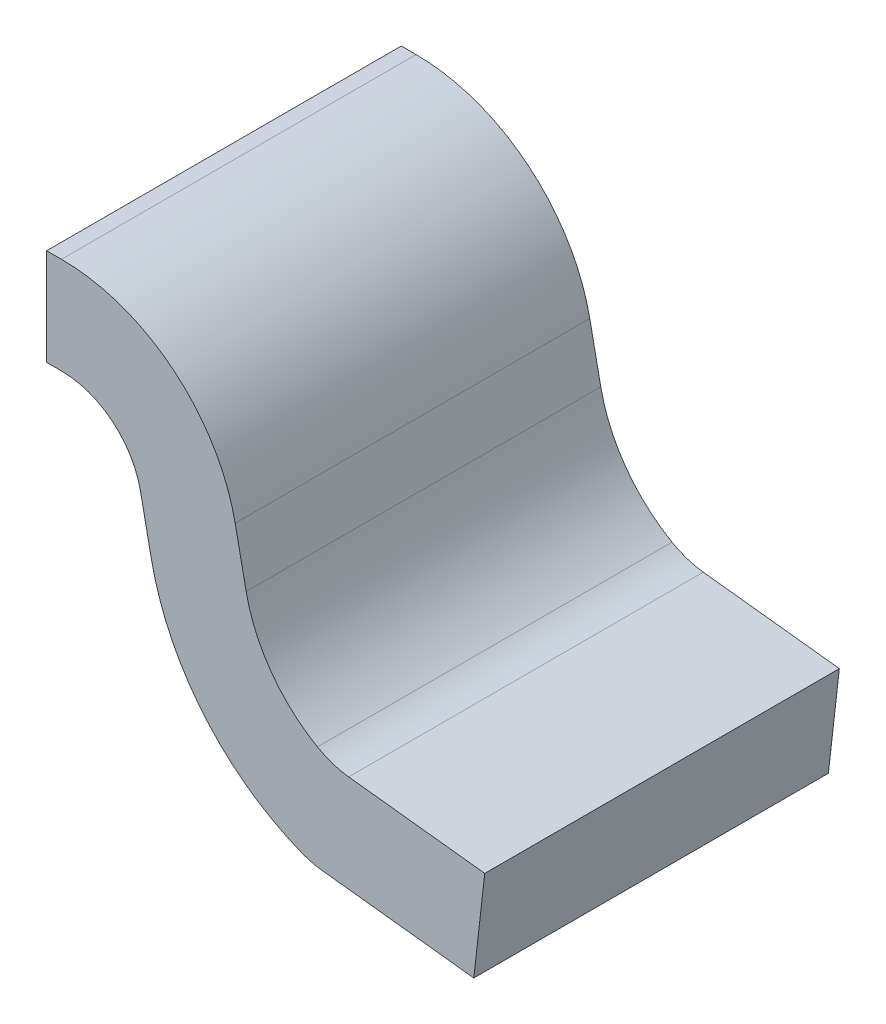
ISO-10303-21;
HEADER;
FILE_DESCRIPTION(('STEP AP214'),'2;1');
FILE_NAME('part.step','',(''),(''),'','','');
FILE_SCHEMA(('AUTOMOTIVE_DESIGN { 1 0 10303 214 1 1 1 1 }'));
ENDSEC;
DATA;
#1=APPLICATION_CONTEXT('core data for automotive mechanical design processes');
#2=APPLICATION_PROTOCOL_DEFINITION('international standard','automotive_design',2000,#1);
#3=PRODUCT_CONTEXT('',#1,'mechanical');
#4=PRODUCT('Part','Part','',(#3));
#5=PRODUCT_RELATED_PRODUCT_CATEGORY('part','',(#4));
#6=PRODUCT_DEFINITION_FORMATION('','',#4);
#7=PRODUCT_DEFINITION_CONTEXT('part definition',#1,'design');
#8=PRODUCT_DEFINITION('design','',#6,#7);
#9=PRODUCT_DEFINITION_SHAPE('','',#8);
#10=(LENGTH_UNIT() NAMED_UNIT(*) SI_UNIT(.MILLI.,.METRE.));
#11=(NAMED_UNIT(*) PLANE_ANGLE_UNIT() SI_UNIT($,.RADIAN.));
#12=(NAMED_UNIT(*) SI_UNIT($,.STERADIAN.) SOLID_ANGLE_UNIT());
#13=UNCERTAINTY_MEASURE_WITH_UNIT(LENGTH_MEASURE(1.E-05),#10,'distance_accuracy_value','');
#14=(GEOMETRIC_REPRESENTATION_CONTEXT(3) GLOBAL_UNCERTAINTY_ASSIGNED_CONTEXT((#13)) GLOBAL_UNIT_ASSIGNED_CONTEXT((#10,
#11,#12)) REPRESENTATION_CONTEXT('',''));
#15=CARTESIAN_POINT('',(0.,0.,0.));
#16=DIRECTION('',(0.,0.,1.));
#17=DIRECTION('',(1.,0.,0.));
#18=AXIS2_PLACEMENT_3D('',#15,#16,#17);
#19=CARTESIAN_POINT('',(1.0784798395513,0.311122151443952,3.64984430510635));
#20=DIRECTION('',(0.,0.,-1.));
#21=DIRECTION('',(-1.,0.,0.));
#22=AXIS2_PLACEMENT_3D('',#19,#20,#21);
#23=CYLINDRICAL_SURFACE('',#22,0.304673812487565);
#24=DIRECTION('',(0.,0.,1.));
#25=VECTOR('',#24,1.);
#26=CARTESIAN_POINT('',(0.966363747755728,0.0278270509282633,3.64984430510635));
#27=LINE('',#26,#25);
#28=CARTESIAN_POINT('',(0.966363747755728,0.0278270509282633,2.18));
#29=VERTEX_POINT('',#28);
#30=CARTESIAN_POINT('',(0.966363747755728,0.0278270509282633,2.62));
#31=VERTEX_POINT('',#30);
#32=EDGE_CURVE('E11',#29,#31,#27,.T.);
#33=ORIENTED_EDGE('',*,*,#32,.T.);
#34=CARTESIAN_POINT('',(1.0784798395513,0.311122151443952,2.62));
#35=DIRECTION('',(0.,0.,-1.));
#36=DIRECTION('',(-1.,0.,0.));
#37=AXIS2_PLACEMENT_3D('',#34,#35,#36);
#38=CIRCLE('',#37,0.304673812487565);
#39=CARTESIAN_POINT('',(0.78,0.25,2.62));
#40=VERTEX_POINT('',#39);
#41=EDGE_CURVE('E26',#31,#40,#38,.T.);
#42=ORIENTED_EDGE('',*,*,#41,.T.);
#43=DIRECTION('',(0.,0.,-1.));
#44=VECTOR('',#43,1.);
#45=CARTESIAN_POINT('',(0.78,0.25,3.64984430510635));
#46=LINE('',#45,#44);
#47=CARTESIAN_POINT('',(0.78,0.25,2.18));
#48=VERTEX_POINT('',#47);
#49=EDGE_CURVE('E252',#40,#48,#46,.T.);
#50=ORIENTED_EDGE('',*,*,#49,.T.);
#51=CARTESIAN_POINT('',(1.0784798395513,0.311122151443952,2.18));
#52=DIRECTION('',(0.,0.,1.));
#53=DIRECTION('',(-1.,0.,0.));
#54=AXIS2_PLACEMENT_3D('',#51,#52,#53);
#55=CIRCLE('',#54,0.304673812487565);
#56=EDGE_CURVE('E150',#48,#29,#55,.T.);
#57=ORIENTED_EDGE('',*,*,#56,.T.);
#58=EDGE_LOOP('',(#33,#42,#50,#57));
#59=FACE_BOUND('',#58,.T.);
#60=ADVANCED_FACE('F16',(#59),#23,.T.);
#61=CARTESIAN_POINT('',(-2.74150408033977,0.,2.62));
#62=DIRECTION('',(0.,0.,-1.));
#63=DIRECTION('',(0.707106781186548,0.707106781186548,0.));
#64=AXIS2_PLACEMENT_3D('',#61,#62,#63);
#65=PLANE('',#64);
#66=DIRECTION('',(-0.200615047761769,0.979670149903294,0.));
#67=VECTOR('',#66,1.);
#68=CARTESIAN_POINT('',(0.78,0.25,2.62));
#69=LINE('',#68,#67);
#70=CARTESIAN_POINT('',(0.766369657725015,0.316561504776177,2.62));
#71=VERTEX_POINT('',#70);
#72=EDGE_CURVE('E190',#40,#71,#69,.T.);
#73=ORIENTED_EDGE('',*,*,#72,.F.);
#74=ORIENTED_EDGE('',*,*,#41,.F.);
#75=CARTESIAN_POINT('',(1.003162477151,0.120810132802834,2.62));
#76=DIRECTION('',(0.,0.,-1.));
#77=DIRECTION('',(-1.,0.,0.));
#78=AXIS2_PLACEMENT_3D('',#75,#76,#77);
#79=CIRCLE('',#78,0.1);
#80=CARTESIAN_POINT('',(0.991834300901522,0.0214538424993983,2.62));
#81=VERTEX_POINT('',#80);
#82=EDGE_CURVE('E151',#81,#31,#79,.T.);
#83=ORIENTED_EDGE('',*,*,#82,.F.);
#84=DIRECTION('',(-0.993562903034357,0.113281762494854,0.));
#85=VECTOR('',#84,1.);
#86=CARTESIAN_POINT('',(1.17999999999987,0.,2.62));
#87=LINE('',#86,#85);
#88=CARTESIAN_POINT('',(1.17999999999987,0.,2.62));
#89=VERTEX_POINT('',#88);
#90=EDGE_CURVE('E184',#89,#81,#87,.T.);
#91=ORIENTED_EDGE('',*,*,#90,.F.);
#92=DIRECTION('',(-0.113281762495859,-0.993562903034243,0.));
#93=VECTOR('',#92,1.);
#94=CARTESIAN_POINT('',(1.19359381149938,0.119227548364123,2.62));
#95=LINE('',#94,#93);
#96=CARTESIAN_POINT('',(1.19359381149938,0.119227548364123,2.62));
#97=VERTEX_POINT('',#96);
#98=EDGE_CURVE('E185',#97,#89,#95,.T.);
#99=ORIENTED_EDGE('',*,*,#98,.F.);
#100=DIRECTION('',(0.993562903034362,-0.113281762494814,0.));
#101=VECTOR('',#100,1.);
#102=CARTESIAN_POINT('',(1.02473971532561,0.138479565081551,2.62));
#103=LINE('',#102,#101);
#104=CARTESIAN_POINT('',(1.02473971532561,0.138479565081551,2.62));
#105=VERTEX_POINT('',#104);
#106=EDGE_CURVE('E180',#105,#97,#103,.T.);
#107=ORIENTED_EDGE('',*,*,#106,.F.);
#108=CARTESIAN_POINT('',(1.03606789157509,0.237835855384987,2.62));
#109=DIRECTION('',(0.,0.,1.));
#110=DIRECTION('',(-1.,0.,0.));
#111=AXIS2_PLACEMENT_3D('',#108,#109,#110);
#112=CIRCLE('',#111,0.1);
#113=CARTESIAN_POINT('',(0.985979267087511,0.151284542876497,2.62));
#114=VERTEX_POINT('',#113);
#115=EDGE_CURVE('E175',#114,#105,#112,.T.);
#116=ORIENTED_EDGE('',*,*,#115,.F.);
#117=CARTESIAN_POINT('',(1.0784798395513,0.311122151443952,2.62));
#118=DIRECTION('',(0.,0.,1.));
#119=DIRECTION('',(-1.,0.,0.));
#120=AXIS2_PLACEMENT_3D('',#117,#118,#119);
#121=CIRCLE('',#120,0.184673812487565);
#122=CARTESIAN_POINT('',(0.897560417988396,0.274073805731411,2.62));
#123=VERTEX_POINT('',#122);
#124=EDGE_CURVE('E170',#123,#114,#121,.T.);
#125=ORIENTED_EDGE('',*,*,#124,.F.);
#126=DIRECTION('',(0.20061504776177,-0.979670149903294,0.));
#127=VECTOR('',#126,1.);
#128=CARTESIAN_POINT('',(0.883930075713411,0.340635310507587,2.62));
#129=LINE('',#128,#127);
#130=CARTESIAN_POINT('',(0.883930075713411,0.340635310507588,2.62));
#131=VERTEX_POINT('',#130);
#132=EDGE_CURVE('E165',#131,#123,#129,.T.);
#133=ORIENTED_EDGE('',*,*,#132,.F.);
#134=CARTESIAN_POINT('',(0.668402642734686,0.2965,2.62));
#135=DIRECTION('',(0.,0.,-1.));
#136=DIRECTION('',(-1.,0.,0.));
#137=AXIS2_PLACEMENT_3D('',#134,#135,#136);
#138=CIRCLE('',#137,0.22);
#139=CARTESIAN_POINT('',(0.668402642734686,0.5165,2.62));
#140=VERTEX_POINT('',#139);
#141=EDGE_CURVE('E208',#140,#131,#138,.T.);
#142=ORIENTED_EDGE('',*,*,#141,.F.);
#143=DIRECTION('',(1.,0.,0.));
#144=VECTOR('',#143,1.);
#145=CARTESIAN_POINT('',(-2.74150408033977,0.5165,2.62));
#146=LINE('',#145,#144);
#147=CARTESIAN_POINT('',(0.65,0.5165,2.62));
#148=VERTEX_POINT('',#147);
#149=EDGE_CURVE('E132',#148,#140,#146,.T.);
#150=ORIENTED_EDGE('',*,*,#149,.F.);
#151=DIRECTION('',(0.,1.,0.));
#152=VECTOR('',#151,1.);
#153=CARTESIAN_POINT('',(0.65,0.,2.62));
#154=LINE('',#153,#152);
#155=CARTESIAN_POINT('',(0.65,0.3965,2.62));
#156=VERTEX_POINT('',#155);
#157=EDGE_CURVE('E133',#156,#148,#154,.T.);
#158=ORIENTED_EDGE('',*,*,#157,.F.);
#159=DIRECTION('',(-1.,0.,0.));
#160=VECTOR('',#159,1.);
#161=CARTESIAN_POINT('',(-2.74150408033977,0.3965,2.62));
#162=LINE('',#161,#160);
#163=CARTESIAN_POINT('',(0.668402642734686,0.3965,2.62));
#164=VERTEX_POINT('',#163);
#165=EDGE_CURVE('E135',#164,#156,#162,.T.);
#166=ORIENTED_EDGE('',*,*,#165,.F.);
#167=CARTESIAN_POINT('',(0.668402642734686,0.2965,2.62));
#168=DIRECTION('',(0.,0.,1.));
#169=DIRECTION('',(-1.,0.,0.));
#170=AXIS2_PLACEMENT_3D('',#167,#168,#169);
#171=CIRCLE('',#170,0.1);
#172=EDGE_CURVE('E142',#71,#164,#171,.T.);
#173=ORIENTED_EDGE('',*,*,#172,.F.);
#174=EDGE_LOOP('',(#73,#74,#83,#91,#99,#107,#116,#125,#133,#142,#150,#158,#166,#173));
#175=FACE_BOUND('',#174,.T.);
#176=ADVANCED_FACE('F212',(#175),#65,.F.);
#177=CARTESIAN_POINT('',(1.003162477151,0.120810132802834,3.64984430510635));
#178=DIRECTION('',(0.,0.,-1.));
#179=DIRECTION('',(-1.,0.,0.));
#180=AXIS2_PLACEMENT_3D('',#177,#178,#179);
#181=CYLINDRICAL_SURFACE('',#180,0.1);
#182=DIRECTION('',(0.,0.,1.));
#183=VECTOR('',#182,1.);
#184=CARTESIAN_POINT('',(0.991834300901524,0.0214538424993981,3.64984430510635));
#185=LINE('',#184,#183);
#186=CARTESIAN_POINT('',(0.991834300901522,0.0214538424993983,2.18));
#187=VERTEX_POINT('',#186);
#188=EDGE_CURVE('E147',#187,#81,#185,.T.);
#189=ORIENTED_EDGE('',*,*,#188,.T.);
#190=ORIENTED_EDGE('',*,*,#82,.T.);
#191=ORIENTED_EDGE('',*,*,#32,.F.);
#192=CARTESIAN_POINT('',(1.003162477151,0.120810132802834,2.18));
#193=DIRECTION('',(0.,0.,1.));
#194=DIRECTION('',(-1.,0.,0.));
#195=AXIS2_PLACEMENT_3D('',#192,#193,#194);
#196=CIRCLE('',#195,0.1);
#197=EDGE_CURVE('E152',#29,#187,#196,.T.);
#198=ORIENTED_EDGE('',*,*,#197,.T.);
#199=EDGE_LOOP('',(#189,#190,#191,#198));
#200=FACE_BOUND('',#199,.T.);
#201=ADVANCED_FACE('F247',(#200),#181,.T.);
#202=CARTESIAN_POINT('',(-2.74150408033977,0.,2.18));
#203=DIRECTION('',(0.,0.,1.));
#204=DIRECTION('',(0.707106781186548,0.707106781186548,0.));
#205=AXIS2_PLACEMENT_3D('',#202,#203,#204);
#206=PLANE('',#205);
#207=DIRECTION('',(-1.,0.,0.));
#208=VECTOR('',#207,1.);
#209=CARTESIAN_POINT('',(-2.74150408033977,0.5165,2.18));
#210=LINE('',#209,#208);
#211=CARTESIAN_POINT('',(0.668402642734686,0.5165,2.18));
#212=VERTEX_POINT('',#211);
#213=CARTESIAN_POINT('',(0.65,0.5165,2.18));
#214=VERTEX_POINT('',#213);
#215=EDGE_CURVE('E155',#212,#214,#210,.T.);
#216=ORIENTED_EDGE('',*,*,#215,.F.);
#217=CARTESIAN_POINT('',(0.668402642734686,0.2965,2.18));
#218=DIRECTION('',(0.,0.,1.));
#219=DIRECTION('',(-1.,0.,0.));
#220=AXIS2_PLACEMENT_3D('',#217,#218,#219);
#221=CIRCLE('',#220,0.22);
#222=CARTESIAN_POINT('',(0.883930075713411,0.340635310507588,2.18));
#223=VERTEX_POINT('',#222);
#224=EDGE_CURVE('E157',#223,#212,#221,.T.);
#225=ORIENTED_EDGE('',*,*,#224,.F.);
#226=DIRECTION('',(-0.20061504776177,0.979670149903294,0.));
#227=VECTOR('',#226,1.);
#228=CARTESIAN_POINT('',(0.897560417988396,0.274073805731412,2.18));
#229=LINE('',#228,#227);
#230=CARTESIAN_POINT('',(0.897560417988396,0.274073805731411,2.18));
#231=VERTEX_POINT('',#230);
#232=EDGE_CURVE('E161',#231,#223,#229,.T.);
#233=ORIENTED_EDGE('',*,*,#232,.F.);
#234=CARTESIAN_POINT('',(1.0784798395513,0.311122151443952,2.18));
#235=DIRECTION('',(0.,0.,-1.));
#236=DIRECTION('',(-1.,0.,0.));
#237=AXIS2_PLACEMENT_3D('',#234,#235,#236);
#238=CIRCLE('',#237,0.184673812487565);
#239=CARTESIAN_POINT('',(0.985979267087511,0.151284542876497,2.18));
#240=VERTEX_POINT('',#239);
#241=EDGE_CURVE('E166',#240,#231,#238,.T.);
#242=ORIENTED_EDGE('',*,*,#241,.F.);
#243=CARTESIAN_POINT('',(1.03606789157509,0.237835855384987,2.18));
#244=DIRECTION('',(0.,0.,-1.));
#245=DIRECTION('',(-1.,0.,0.));
#246=AXIS2_PLACEMENT_3D('',#243,#244,#245);
#247=CIRCLE('',#246,0.1);
#248=CARTESIAN_POINT('',(1.02473971532561,0.138479565081551,2.18));
#249=VERTEX_POINT('',#248);
#250=EDGE_CURVE('E171',#249,#240,#247,.T.);
#251=ORIENTED_EDGE('',*,*,#250,.F.);
#252=DIRECTION('',(-0.993562903034363,0.113281762494801,0.));
#253=VECTOR('',#252,1.);
#254=CARTESIAN_POINT('',(1.19359381149938,0.119227548364125,2.18));
#255=LINE('',#254,#253);
#256=CARTESIAN_POINT('',(1.19359381149938,0.119227548364124,2.18));
#257=VERTEX_POINT('',#256);
#258=EDGE_CURVE('E176',#257,#249,#255,.T.);
#259=ORIENTED_EDGE('',*,*,#258,.F.);
#260=DIRECTION('',(0.113281762495857,0.993562903034243,0.));
#261=VECTOR('',#260,1.);
#262=CARTESIAN_POINT('',(1.17999999999987,0.,2.18));
#263=LINE('',#262,#261);
#264=CARTESIAN_POINT('',(1.17999999999987,0.,2.18));
#265=VERTEX_POINT('',#264);
#266=EDGE_CURVE('E181',#265,#257,#263,.T.);
#267=ORIENTED_EDGE('',*,*,#266,.F.);
#268=DIRECTION('',(0.993562903034357,-0.113281762494854,0.));
#269=VECTOR('',#268,1.);
#270=CARTESIAN_POINT('',(0.991834300901524,0.0214538424993981,2.18));
#271=LINE('',#270,#269);
#272=EDGE_CURVE('E146',#187,#265,#271,.T.);
#273=ORIENTED_EDGE('',*,*,#272,.F.);
#274=ORIENTED_EDGE('',*,*,#197,.F.);
#275=ORIENTED_EDGE('',*,*,#56,.F.);
#276=DIRECTION('',(0.200615047761769,-0.979670149903294,0.));
#277=VECTOR('',#276,1.);
#278=CARTESIAN_POINT('',(0.766369657725015,0.316561504776176,2.18));
#279=LINE('',#278,#277);
#280=CARTESIAN_POINT('',(0.766369657725015,0.316561504776177,2.18));
#281=VERTEX_POINT('',#280);
#282=EDGE_CURVE('E154',#281,#48,#279,.T.);
#283=ORIENTED_EDGE('',*,*,#282,.F.);
#284=CARTESIAN_POINT('',(0.668402642734686,0.2965,2.18));
#285=DIRECTION('',(0.,0.,-1.));
#286=DIRECTION('',(-1.,0.,0.));
#287=AXIS2_PLACEMENT_3D('',#284,#285,#286);
#288=CIRCLE('',#287,0.1);
#289=CARTESIAN_POINT('',(0.668402642734686,0.3965,2.18));
#290=VERTEX_POINT('',#289);
#291=EDGE_CURVE('E122',#290,#281,#288,.T.);
#292=ORIENTED_EDGE('',*,*,#291,.F.);
#293=DIRECTION('',(1.,0.,0.));
#294=VECTOR('',#293,1.);
#295=CARTESIAN_POINT('',(-2.74150408033977,0.3965,2.18));
#296=LINE('',#295,#294);
#297=CARTESIAN_POINT('',(0.65,0.3965,2.18));
#298=VERTEX_POINT('',#297);
#299=EDGE_CURVE('E114',#298,#290,#296,.T.);
#300=ORIENTED_EDGE('',*,*,#299,.F.);
#301=DIRECTION('',(0.,-1.,0.));
#302=VECTOR('',#301,1.);
#303=CARTESIAN_POINT('',(0.65,0.,2.18));
#304=LINE('',#303,#302);
#305=EDGE_CURVE('E119',#214,#298,#304,.T.);
#306=ORIENTED_EDGE('',*,*,#305,.F.);
#307=EDGE_LOOP('',(#216,#225,#233,#242,#251,#259,#267,#273,#274,#275,#283,#292,#300,#306));
#308=FACE_BOUND('',#307,.T.);
#309=ADVANCED_FACE('F118',(#308),#206,.F.);
#310=CARTESIAN_POINT('',(0.766369657725015,0.316561504776176,3.64984430510635));
#311=DIRECTION('',(0.979670149903295,0.200615047761767,0.));
#312=DIRECTION('',(-0.143305470647058,0.699808381659803,0.699808381659803));
#313=AXIS2_PLACEMENT_3D('',#310,#311,#312);
#314=PLANE('',#313);
#315=ORIENTED_EDGE('',*,*,#282,.T.);
#316=ORIENTED_EDGE('',*,*,#49,.F.);
#317=ORIENTED_EDGE('',*,*,#72,.T.);
#318=DIRECTION('',(0.,0.,1.));
#319=VECTOR('',#318,1.);
#320=CARTESIAN_POINT('',(0.766369657725015,0.316561504776176,3.64984430510635));
#321=LINE('',#320,#319);
#322=EDGE_CURVE('E145',#281,#71,#321,.T.);
#323=ORIENTED_EDGE('',*,*,#322,.F.);
#324=EDGE_LOOP('',(#315,#316,#317,#323));
#325=FACE_BOUND('',#324,.T.);
#326=ADVANCED_FACE('F268',(#325),#314,.F.);
#327=CARTESIAN_POINT('',(0.668402642734686,0.2965,3.64984430510635));
#328=DIRECTION('',(0.,0.,-1.));
#329=DIRECTION('',(-1.,0.,0.));
#330=AXIS2_PLACEMENT_3D('',#327,#328,#329);
#331=CYLINDRICAL_SURFACE('',#330,0.1);
#332=ORIENTED_EDGE('',*,*,#291,.T.);
#333=ORIENTED_EDGE('',*,*,#322,.T.);
#334=ORIENTED_EDGE('',*,*,#172,.T.);
#335=DIRECTION('',(0.,0.,1.));
#336=VECTOR('',#335,1.);
#337=CARTESIAN_POINT('',(0.668402642734685,0.3965,3.64984430510635));
#338=LINE('',#337,#336);
#339=EDGE_CURVE('E125',#290,#164,#338,.T.);
#340=ORIENTED_EDGE('',*,*,#339,.F.);
#341=EDGE_LOOP('',(#332,#333,#334,#340));
#342=FACE_BOUND('',#341,.T.);
#343=ADVANCED_FACE('F270',(#342),#331,.F.);
#344=CARTESIAN_POINT('',(1.18,0.,3.64984430510635));
#345=DIRECTION('',(0.113281762494813,0.993562903034362,0.));
#346=DIRECTION('',(0.704819900881673,-0.0803605291315247,0.704819900881673));
#347=AXIS2_PLACEMENT_3D('',#344,#345,#346);
#348=PLANE('',#347);
#349=ORIENTED_EDGE('',*,*,#272,.T.);
#350=DIRECTION('',(0.,0.,-1.));
#351=VECTOR('',#350,1.);
#352=CARTESIAN_POINT('',(1.17999999999987,0.,3.64984430510635));
#353=LINE('',#352,#351);
#354=EDGE_CURVE('E179',#89,#265,#353,.T.);
#355=ORIENTED_EDGE('',*,*,#354,.F.);
#356=ORIENTED_EDGE('',*,*,#90,.T.);
#357=ORIENTED_EDGE('',*,*,#188,.F.);
#358=EDGE_LOOP('',(#349,#355,#356,#357));
#359=FACE_BOUND('',#358,.T.);
#360=ADVANCED_FACE('F244',(#359),#348,.F.);
#361=CARTESIAN_POINT('',(1.19359381149938,0.119227548364123,3.64984430510635));
#362=DIRECTION('',(-0.993562903034362,0.113281762494813,0.));
#363=DIRECTION('',(0.080360529131525,0.704819900881673,0.704819900881673));
#364=AXIS2_PLACEMENT_3D('',#361,#362,#363);
#365=PLANE('',#364);
#366=ORIENTED_EDGE('',*,*,#266,.T.);
#367=DIRECTION('',(0.,0.,-1.));
#368=VECTOR('',#367,1.);
#369=CARTESIAN_POINT('',(1.19359381149938,0.119227548364123,3.64984430510635));
#370=LINE('',#369,#368);
#371=EDGE_CURVE('E174',#97,#257,#370,.T.);
#372=ORIENTED_EDGE('',*,*,#371,.F.);
#373=ORIENTED_EDGE('',*,*,#98,.T.);
#374=ORIENTED_EDGE('',*,*,#354,.T.);
#375=EDGE_LOOP('',(#366,#372,#373,#374));
#376=FACE_BOUND('',#375,.T.);
#377=ADVANCED_FACE('F237',(#376),#365,.F.);
#378=CARTESIAN_POINT('',(1.19359381149938,0.119227548364123,3.64984430510635));
#379=DIRECTION('',(-0.113281762494812,-0.993562903034362,0.));
#380=DIRECTION('',(0.704819900881673,-0.0803605291315244,0.704819900881673));
#381=AXIS2_PLACEMENT_3D('',#378,#379,#380);
#382=PLANE('',#381);
#383=ORIENTED_EDGE('',*,*,#258,.T.);
#384=DIRECTION('',(0.,0.,-1.));
#385=VECTOR('',#384,1.);
#386=CARTESIAN_POINT('',(1.02473971532561,0.138479565081551,3.64984430510635));
#387=LINE('',#386,#385);
#388=EDGE_CURVE('E169',#105,#249,#387,.T.);
#389=ORIENTED_EDGE('',*,*,#388,.F.);
#390=ORIENTED_EDGE('',*,*,#106,.T.);
#391=ORIENTED_EDGE('',*,*,#371,.T.);
#392=EDGE_LOOP('',(#383,#389,#390,#391));
#393=FACE_BOUND('',#392,.T.);
#394=ADVANCED_FACE('F233',(#393),#382,.F.);
#395=CARTESIAN_POINT('',(1.03606789157509,0.237835855384987,3.64984430510635));
#396=DIRECTION('',(0.,0.,-1.));
#397=DIRECTION('',(-1.,0.,0.));
#398=AXIS2_PLACEMENT_3D('',#395,#396,#397);
#399=CYLINDRICAL_SURFACE('',#398,0.1);
#400=ORIENTED_EDGE('',*,*,#250,.T.);
#401=DIRECTION('',(0.,0.,-1.));
#402=VECTOR('',#401,1.);
#403=CARTESIAN_POINT('',(0.985979267087511,0.151284542876497,3.64984430510635));
#404=LINE('',#403,#402);
#405=EDGE_CURVE('E164',#114,#240,#404,.T.);
#406=ORIENTED_EDGE('',*,*,#405,.F.);
#407=ORIENTED_EDGE('',*,*,#115,.T.);
#408=ORIENTED_EDGE('',*,*,#388,.T.);
#409=EDGE_LOOP('',(#400,#406,#407,#408));
#410=FACE_BOUND('',#409,.T.);
#411=ADVANCED_FACE('F229',(#410),#399,.F.);
#412=CARTESIAN_POINT('',(1.0784798395513,0.311122151443952,3.64984430510635));
#413=DIRECTION('',(0.,0.,-1.));
#414=DIRECTION('',(-1.,0.,0.));
#415=AXIS2_PLACEMENT_3D('',#412,#413,#414);
#416=CYLINDRICAL_SURFACE('',#415,0.184673812487565);
#417=ORIENTED_EDGE('',*,*,#241,.T.);
#418=DIRECTION('',(0.,0.,-1.));
#419=VECTOR('',#418,1.);
#420=CARTESIAN_POINT('',(0.897560417988396,0.274073805731412,3.64984430510635));
#421=LINE('',#420,#419);
#422=EDGE_CURVE('E202',#123,#231,#421,.T.);
#423=ORIENTED_EDGE('',*,*,#422,.F.);
#424=ORIENTED_EDGE('',*,*,#124,.T.);
#425=ORIENTED_EDGE('',*,*,#405,.T.);
#426=EDGE_LOOP('',(#417,#423,#424,#425));
#427=FACE_BOUND('',#426,.T.);
#428=ADVANCED_FACE('F225',(#427),#416,.F.);
#429=CARTESIAN_POINT('',(0.883930075713411,0.340635310507587,3.64984430510635));
#430=DIRECTION('',(-0.979670149903295,-0.200615047761767,0.));
#431=DIRECTION('',(-0.143305470647059,0.699808381659803,0.699808381659803));
#432=AXIS2_PLACEMENT_3D('',#429,#430,#431);
#433=PLANE('',#432);
#434=ORIENTED_EDGE('',*,*,#232,.T.);
#435=DIRECTION('',(0.,0.,-1.));
#436=VECTOR('',#435,1.);
#437=CARTESIAN_POINT('',(0.883930075713411,0.340635310507587,3.64984430510635));
#438=LINE('',#437,#436);
#439=EDGE_CURVE('E160',#131,#223,#438,.T.);
#440=ORIENTED_EDGE('',*,*,#439,.F.);
#441=ORIENTED_EDGE('',*,*,#132,.T.);
#442=ORIENTED_EDGE('',*,*,#422,.T.);
#443=EDGE_LOOP('',(#434,#440,#441,#442));
#444=FACE_BOUND('',#443,.T.);
#445=ADVANCED_FACE('F221',(#444),#433,.F.);
#446=CARTESIAN_POINT('',(0.668402642734686,0.2965,3.64984430510635));
#447=DIRECTION('',(0.,0.,-1.));
#448=DIRECTION('',(-1.,0.,0.));
#449=AXIS2_PLACEMENT_3D('',#446,#447,#448);
#450=CYLINDRICAL_SURFACE('',#449,0.22);
#451=DIRECTION('',(0.,0.,1.));
#452=VECTOR('',#451,1.);
#453=CARTESIAN_POINT('',(0.668402642734685,0.5165,3.64984430510635));
#454=LINE('',#453,#452);
#455=EDGE_CURVE('E205',#212,#140,#454,.T.);
#456=ORIENTED_EDGE('',*,*,#455,.T.);
#457=ORIENTED_EDGE('',*,*,#141,.T.);
#458=ORIENTED_EDGE('',*,*,#439,.T.);
#459=ORIENTED_EDGE('',*,*,#224,.T.);
#460=EDGE_LOOP('',(#456,#457,#458,#459));
#461=FACE_BOUND('',#460,.T.);
#462=ADVANCED_FACE('F218',(#461),#450,.T.);
#463=CARTESIAN_POINT('',(0.65,0.5165,3.64984430510635));
#464=DIRECTION('',(0.,-1.,0.));
#465=DIRECTION('',(0.707106781186548,0.,0.707106781186548));
#466=AXIS2_PLACEMENT_3D('',#463,#464,#465);
#467=PLANE('',#466);
#468=ORIENTED_EDGE('',*,*,#215,.T.);
#469=DIRECTION('',(0.,0.,-1.));
#470=VECTOR('',#469,1.);
#471=CARTESIAN_POINT('',(0.65,0.5165,3.64984430510635));
#472=LINE('',#471,#470);
#473=EDGE_CURVE('E124',#148,#214,#472,.T.);
#474=ORIENTED_EDGE('',*,*,#473,.F.);
#475=ORIENTED_EDGE('',*,*,#149,.T.);
#476=ORIENTED_EDGE('',*,*,#455,.F.);
#477=EDGE_LOOP('',(#468,#474,#475,#476));
#478=FACE_BOUND('',#477,.T.);
#479=ADVANCED_FACE('F216',(#478),#467,.F.);
#480=CARTESIAN_POINT('',(0.65,0.5165,3.64984430510635));
#481=DIRECTION('',(1.,0.,0.));
#482=DIRECTION('',(0.,0.707106781186548,0.707106781186548));
#483=AXIS2_PLACEMENT_3D('',#480,#481,#482);
#484=PLANE('',#483);
#485=ORIENTED_EDGE('',*,*,#305,.T.);
#486=DIRECTION('',(0.,0.,-1.));
#487=VECTOR('',#486,1.);
#488=CARTESIAN_POINT('',(0.65,0.3965,3.64984430510635));
#489=LINE('',#488,#487);
#490=EDGE_CURVE('E20',#156,#298,#489,.T.);
#491=ORIENTED_EDGE('',*,*,#490,.F.);
#492=ORIENTED_EDGE('',*,*,#157,.T.);
#493=ORIENTED_EDGE('',*,*,#473,.T.);
#494=EDGE_LOOP('',(#485,#491,#492,#493));
#495=FACE_BOUND('',#494,.T.);
#496=ADVANCED_FACE('F130',(#495),#484,.F.);
#497=CARTESIAN_POINT('',(0.65,0.3965,3.64984430510635));
#498=DIRECTION('',(0.,1.,0.));
#499=DIRECTION('',(0.707106781186548,0.,0.707106781186548));
#500=AXIS2_PLACEMENT_3D('',#497,#498,#499);
#501=PLANE('',#500);
#502=ORIENTED_EDGE('',*,*,#299,.T.);
#503=ORIENTED_EDGE('',*,*,#339,.T.);
#504=ORIENTED_EDGE('',*,*,#165,.T.);
#505=ORIENTED_EDGE('',*,*,#490,.T.);
#506=EDGE_LOOP('',(#502,#503,#504,#505));
#507=FACE_BOUND('',#506,.T.);
#508=ADVANCED_FACE('F18',(#507),#501,.F.);
#509=CLOSED_SHELL('',(#60,#176,#201,#309,#326,#343,#360,#377,#394,#411,#428,#445,#462,#479,#496,#508));
#510=MANIFOLD_SOLID_BREP('B1',#509);
#511=ADVANCED_BREP_SHAPE_REPRESENTATION('',(#18,#510),#14);
#512=SHAPE_DEFINITION_REPRESENTATION(#9,#511);
ENDSEC;
END-ISO-10303-21;
